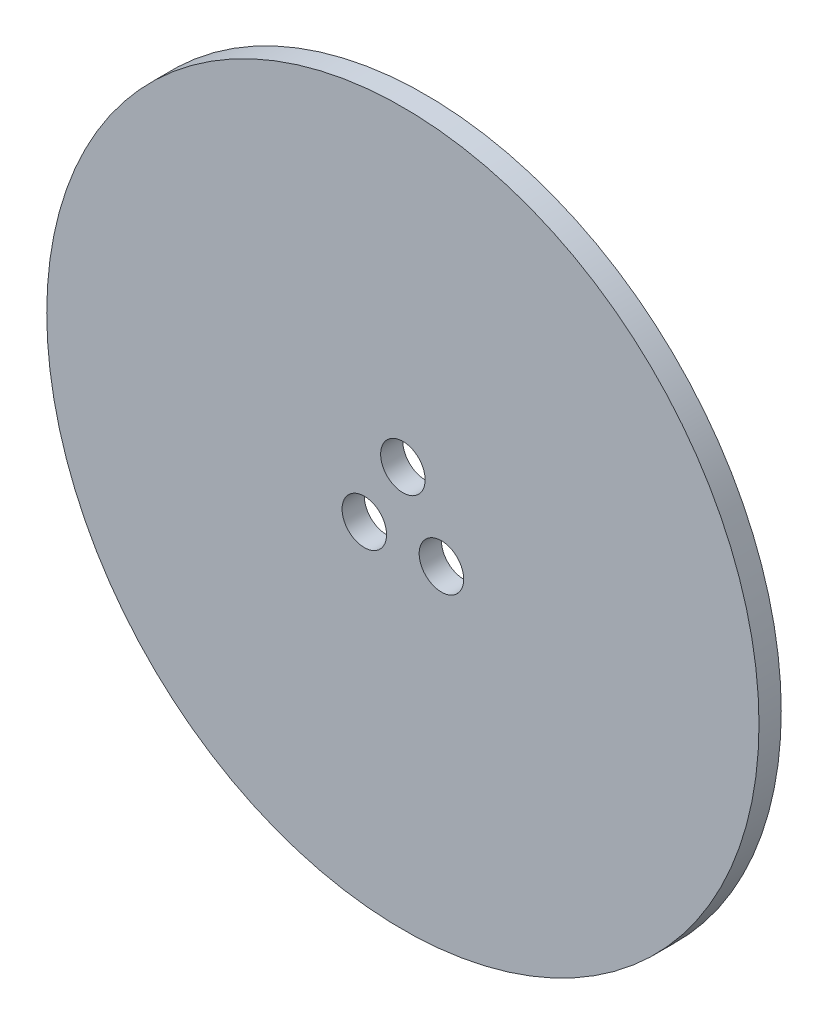
ISO-10303-21;
HEADER;
FILE_DESCRIPTION(('STEP AP214'),'2;1');
FILE_NAME('part.step','',(''),(''),'','','');
FILE_SCHEMA(('AUTOMOTIVE_DESIGN { 1 0 10303 214 1 1 1 1 }'));
ENDSEC;
DATA;
#1=APPLICATION_CONTEXT('core data for automotive mechanical design processes');
#2=APPLICATION_PROTOCOL_DEFINITION('international standard','automotive_design',2000,#1);
#3=PRODUCT_CONTEXT('',#1,'mechanical');
#4=PRODUCT('Part','Part','',(#3));
#5=PRODUCT_RELATED_PRODUCT_CATEGORY('part','',(#4));
#6=PRODUCT_DEFINITION_FORMATION('','',#4);
#7=PRODUCT_DEFINITION_CONTEXT('part definition',#1,'design');
#8=PRODUCT_DEFINITION('design','',#6,#7);
#9=PRODUCT_DEFINITION_SHAPE('','',#8);
#10=(LENGTH_UNIT() NAMED_UNIT(*) SI_UNIT(.MILLI.,.METRE.));
#11=(NAMED_UNIT(*) PLANE_ANGLE_UNIT() SI_UNIT($,.RADIAN.));
#12=(NAMED_UNIT(*) SI_UNIT($,.STERADIAN.) SOLID_ANGLE_UNIT());
#13=UNCERTAINTY_MEASURE_WITH_UNIT(LENGTH_MEASURE(1.E-05),#10,'distance_accuracy_value','');
#14=(GEOMETRIC_REPRESENTATION_CONTEXT(3) GLOBAL_UNCERTAINTY_ASSIGNED_CONTEXT((#13)) GLOBAL_UNIT_ASSIGNED_CONTEXT((#10,
#11,#12)) REPRESENTATION_CONTEXT('',''));
#15=CARTESIAN_POINT('',(0.,0.,0.));
#16=DIRECTION('',(0.,0.,1.));
#17=DIRECTION('',(1.,0.,0.));
#18=AXIS2_PLACEMENT_3D('',#15,#16,#17);
#19=CARTESIAN_POINT('',(0.,0.,3.175));
#20=DIRECTION('',(0.,0.,-1.));
#21=DIRECTION('',(-1.,0.,0.));
#22=AXIS2_PLACEMENT_3D('',#19,#20,#21);
#23=CYLINDRICAL_SURFACE('',#22,50.8);
#24=CARTESIAN_POINT('',(0.,0.,3.175));
#25=DIRECTION('',(0.,0.,1.));
#26=DIRECTION('',(1.,0.,0.));
#27=AXIS2_PLACEMENT_3D('',#24,#25,#26);
#28=CIRCLE('',#27,50.8);
#29=CARTESIAN_POINT('',(50.8,0.,3.175));
#30=VERTEX_POINT('',#29);
#31=EDGE_CURVE('E10',#30,#30,#28,.T.);
#32=ORIENTED_EDGE('',*,*,#31,.F.);
#33=EDGE_LOOP('',(#32));
#34=FACE_BOUND('',#33,.T.);
#35=CARTESIAN_POINT('',(0.,0.,0.));
#36=DIRECTION('',(0.,0.,1.));
#37=DIRECTION('',(1.,0.,0.));
#38=AXIS2_PLACEMENT_3D('',#35,#36,#37);
#39=CIRCLE('',#38,50.8);
#40=CARTESIAN_POINT('',(50.8,0.,0.));
#41=VERTEX_POINT('',#40);
#42=EDGE_CURVE('E46',#41,#41,#39,.T.);
#43=ORIENTED_EDGE('',*,*,#42,.T.);
#44=EDGE_LOOP('',(#43));
#45=FACE_BOUND('',#44,.T.);
#46=ADVANCED_FACE('F43',(#34,#45),#23,.T.);
#47=CARTESIAN_POINT('',(0.,0.,3.175));
#48=DIRECTION('',(0.,0.,1.));
#49=DIRECTION('',(1.,0.,0.));
#50=AXIS2_PLACEMENT_3D('',#47,#48,#49);
#51=PLANE('',#50);
#52=CARTESIAN_POINT('',(0.,6.35,3.175));
#53=DIRECTION('',(0.,0.,1.));
#54=DIRECTION('',(1.,0.,0.));
#55=AXIS2_PLACEMENT_3D('',#52,#53,#54);
#56=CIRCLE('',#55,3.175);
#57=CARTESIAN_POINT('',(3.175,6.35,3.175));
#58=VERTEX_POINT('',#57);
#59=EDGE_CURVE('E70',#58,#58,#56,.T.);
#60=ORIENTED_EDGE('',*,*,#59,.F.);
#61=EDGE_LOOP('',(#60));
#62=FACE_BOUND('',#61,.T.);
#63=CARTESIAN_POINT('',(5.49926131403254,-3.17499999999922,3.175));
#64=DIRECTION('',(0.,0.,1.));
#65=DIRECTION('',(1.,0.,0.));
#66=AXIS2_PLACEMENT_3D('',#63,#64,#65);
#67=CIRCLE('',#66,3.175);
#68=CARTESIAN_POINT('',(8.67426131403254,-3.17499999999922,3.175));
#69=VERTEX_POINT('',#68);
#70=EDGE_CURVE('E66',#69,#69,#67,.T.);
#71=ORIENTED_EDGE('',*,*,#70,.F.);
#72=EDGE_LOOP('',(#71));
#73=FACE_BOUND('',#72,.T.);
#74=CARTESIAN_POINT('',(-5.49926131402984,-3.17500000000078,3.175));
#75=DIRECTION('',(0.,0.,1.));
#76=DIRECTION('',(1.,0.,0.));
#77=AXIS2_PLACEMENT_3D('',#74,#75,#76);
#78=CIRCLE('',#77,3.175);
#79=CARTESIAN_POINT('',(-2.32426131402984,-3.17500000000078,3.175));
#80=VERTEX_POINT('',#79);
#81=EDGE_CURVE('E57',#80,#80,#78,.T.);
#82=ORIENTED_EDGE('',*,*,#81,.F.);
#83=EDGE_LOOP('',(#82));
#84=FACE_BOUND('',#83,.T.);
#85=ORIENTED_EDGE('',*,*,#31,.T.);
#86=EDGE_LOOP('',(#85));
#87=FACE_BOUND('',#86,.T.);
#88=ADVANCED_FACE('F83',(#62,#73,#84,#87),#51,.T.);
#89=CARTESIAN_POINT('',(0.,0.,0.));
#90=DIRECTION('',(0.,0.,1.));
#91=DIRECTION('',(1.,0.,0.));
#92=AXIS2_PLACEMENT_3D('',#89,#90,#91);
#93=PLANE('',#92);
#94=CARTESIAN_POINT('',(0.,6.35,0.));
#95=DIRECTION('',(0.,0.,1.));
#96=DIRECTION('',(1.,0.,0.));
#97=AXIS2_PLACEMENT_3D('',#94,#95,#96);
#98=CIRCLE('',#97,3.175);
#99=CARTESIAN_POINT('',(3.175,6.35,0.));
#100=VERTEX_POINT('',#99);
#101=EDGE_CURVE('E55',#100,#100,#98,.F.);
#102=ORIENTED_EDGE('',*,*,#101,.F.);
#103=EDGE_LOOP('',(#102));
#104=FACE_BOUND('',#103,.T.);
#105=CARTESIAN_POINT('',(5.49926131403254,-3.17499999999922,0.));
#106=DIRECTION('',(0.,0.,1.));
#107=DIRECTION('',(1.,0.,0.));
#108=AXIS2_PLACEMENT_3D('',#105,#106,#107);
#109=CIRCLE('',#108,3.175);
#110=CARTESIAN_POINT('',(8.67426131403254,-3.17499999999922,0.));
#111=VERTEX_POINT('',#110);
#112=EDGE_CURVE('E61',#111,#111,#109,.F.);
#113=ORIENTED_EDGE('',*,*,#112,.F.);
#114=EDGE_LOOP('',(#113));
#115=FACE_BOUND('',#114,.T.);
#116=CARTESIAN_POINT('',(-5.49926131402984,-3.17500000000078,0.));
#117=DIRECTION('',(0.,0.,1.));
#118=DIRECTION('',(1.,0.,0.));
#119=AXIS2_PLACEMENT_3D('',#116,#117,#118);
#120=CIRCLE('',#119,3.175);
#121=CARTESIAN_POINT('',(-2.32426131402984,-3.17500000000078,0.));
#122=VERTEX_POINT('',#121);
#123=EDGE_CURVE('E62',#122,#122,#120,.F.);
#124=ORIENTED_EDGE('',*,*,#123,.F.);
#125=EDGE_LOOP('',(#124));
#126=FACE_BOUND('',#125,.T.);
#127=ORIENTED_EDGE('',*,*,#42,.F.);
#128=EDGE_LOOP('',(#127));
#129=FACE_BOUND('',#128,.T.);
#130=ADVANCED_FACE('F86',(#104,#115,#126,#129),#93,.F.);
#131=CARTESIAN_POINT('',(-5.49926131402984,-3.17500000000078,-8.98025612106916));
#132=DIRECTION('',(0.,0.,1.));
#133=DIRECTION('',(1.,0.,0.));
#134=AXIS2_PLACEMENT_3D('',#131,#132,#133);
#135=CYLINDRICAL_SURFACE('',#134,3.175);
#136=ORIENTED_EDGE('',*,*,#123,.T.);
#137=EDGE_LOOP('',(#136));
#138=FACE_BOUND('',#137,.T.);
#139=ORIENTED_EDGE('',*,*,#81,.T.);
#140=EDGE_LOOP('',(#139));
#141=FACE_BOUND('',#140,.T.);
#142=ADVANCED_FACE('F92',(#138,#141),#135,.F.);
#143=CARTESIAN_POINT('',(5.49926131403254,-3.17499999999922,-8.98025612106916));
#144=DIRECTION('',(0.,0.,1.));
#145=DIRECTION('',(1.,0.,0.));
#146=AXIS2_PLACEMENT_3D('',#143,#144,#145);
#147=CYLINDRICAL_SURFACE('',#146,3.175);
#148=ORIENTED_EDGE('',*,*,#112,.T.);
#149=EDGE_LOOP('',(#148));
#150=FACE_BOUND('',#149,.T.);
#151=ORIENTED_EDGE('',*,*,#70,.T.);
#152=EDGE_LOOP('',(#151));
#153=FACE_BOUND('',#152,.T.);
#154=ADVANCED_FACE('F94',(#150,#153),#147,.F.);
#155=CARTESIAN_POINT('',(0.,6.35,-8.98025612106916));
#156=DIRECTION('',(0.,0.,1.));
#157=DIRECTION('',(1.,0.,0.));
#158=AXIS2_PLACEMENT_3D('',#155,#156,#157);
#159=CYLINDRICAL_SURFACE('',#158,3.175);
#160=ORIENTED_EDGE('',*,*,#101,.T.);
#161=EDGE_LOOP('',(#160));
#162=FACE_BOUND('',#161,.T.);
#163=ORIENTED_EDGE('',*,*,#59,.T.);
#164=EDGE_LOOP('',(#163));
#165=FACE_BOUND('',#164,.T.);
#166=ADVANCED_FACE('F81',(#162,#165),#159,.F.);
#167=CLOSED_SHELL('',(#46,#88,#130,#142,#154,#166));
#168=MANIFOLD_SOLID_BREP('B2',#167);
#169=ADVANCED_BREP_SHAPE_REPRESENTATION('',(#18,#168),#14);
#170=SHAPE_DEFINITION_REPRESENTATION(#9,#169);
ENDSEC;
END-ISO-10303-21;
